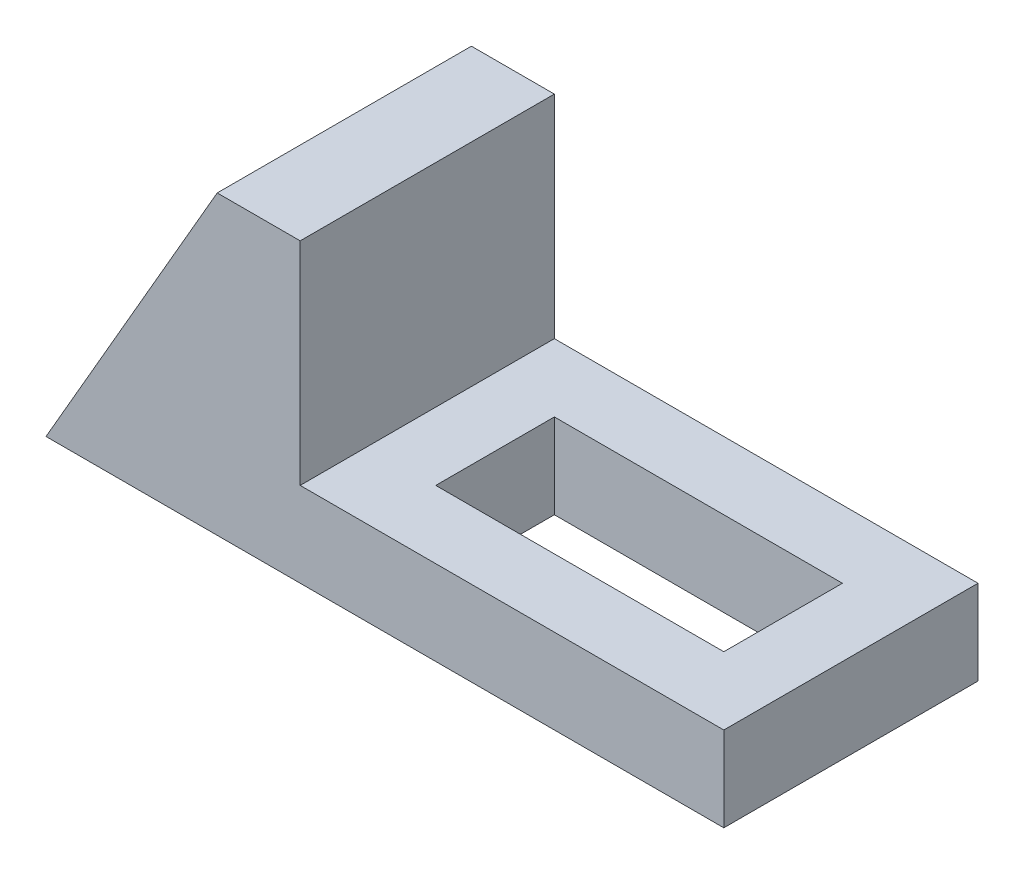
ISO-10303-21;
HEADER;
FILE_DESCRIPTION(('STEP AP214'),'2;1');
FILE_NAME('part.step','',(''),(''),'','','');
FILE_SCHEMA(('AUTOMOTIVE_DESIGN { 1 0 10303 214 1 1 1 1 }'));
ENDSEC;
DATA;
#1=APPLICATION_CONTEXT('core data for automotive mechanical design processes');
#2=APPLICATION_PROTOCOL_DEFINITION('international standard','automotive_design',2000,#1);
#3=PRODUCT_CONTEXT('',#1,'mechanical');
#4=PRODUCT('Part','Part','',(#3));
#5=PRODUCT_RELATED_PRODUCT_CATEGORY('part','',(#4));
#6=PRODUCT_DEFINITION_FORMATION('','',#4);
#7=PRODUCT_DEFINITION_CONTEXT('part definition',#1,'design');
#8=PRODUCT_DEFINITION('design','',#6,#7);
#9=PRODUCT_DEFINITION_SHAPE('','',#8);
#10=(LENGTH_UNIT() NAMED_UNIT(*) SI_UNIT(.MILLI.,.METRE.));
#11=(NAMED_UNIT(*) PLANE_ANGLE_UNIT() SI_UNIT($,.RADIAN.));
#12=(NAMED_UNIT(*) SI_UNIT($,.STERADIAN.) SOLID_ANGLE_UNIT());
#13=UNCERTAINTY_MEASURE_WITH_UNIT(LENGTH_MEASURE(1.E-05),#10,'distance_accuracy_value','');
#14=(GEOMETRIC_REPRESENTATION_CONTEXT(3) GLOBAL_UNCERTAINTY_ASSIGNED_CONTEXT((#13)) GLOBAL_UNIT_ASSIGNED_CONTEXT((#10,
#11,#12)) REPRESENTATION_CONTEXT('',''));
#15=CARTESIAN_POINT('',(0.,0.,0.));
#16=DIRECTION('',(0.,0.,1.));
#17=DIRECTION('',(1.,0.,0.));
#18=AXIS2_PLACEMENT_3D('',#15,#16,#17);
#19=CARTESIAN_POINT('',(80.,0.,30.));
#20=DIRECTION('',(0.,1.,0.));
#21=DIRECTION('',(-1.,0.,0.));
#22=AXIS2_PLACEMENT_3D('',#19,#20,#21);
#23=PLANE('',#22);
#24=DIRECTION('',(-1.,0.,0.));
#25=VECTOR('',#24,1.);
#26=CARTESIAN_POINT('',(80.,0.,8.));
#27=LINE('',#26,#25);
#28=CARTESIAN_POINT('',(72.,0.,8.));
#29=VERTEX_POINT('',#28);
#30=CARTESIAN_POINT('',(38.,0.,8.));
#31=VERTEX_POINT('',#30);
#32=EDGE_CURVE('E140',#29,#31,#27,.T.);
#33=ORIENTED_EDGE('',*,*,#32,.T.);
#34=DIRECTION('',(0.,0.,1.));
#35=VECTOR('',#34,1.);
#36=CARTESIAN_POINT('',(38.,0.,30.));
#37=LINE('',#36,#35);
#38=CARTESIAN_POINT('',(38.,0.,22.));
#39=VERTEX_POINT('',#38);
#40=EDGE_CURVE('E143',#31,#39,#37,.T.);
#41=ORIENTED_EDGE('',*,*,#40,.T.);
#42=DIRECTION('',(1.,0.,0.));
#43=VECTOR('',#42,1.);
#44=CARTESIAN_POINT('',(80.,0.,22.));
#45=LINE('',#44,#43);
#46=CARTESIAN_POINT('',(72.,0.,22.));
#47=VERTEX_POINT('',#46);
#48=EDGE_CURVE('E135',#39,#47,#45,.T.);
#49=ORIENTED_EDGE('',*,*,#48,.T.);
#50=DIRECTION('',(0.,0.,-1.));
#51=VECTOR('',#50,1.);
#52=CARTESIAN_POINT('',(72.,0.,30.));
#53=LINE('',#52,#51);
#54=EDGE_CURVE('E115',#47,#29,#53,.T.);
#55=ORIENTED_EDGE('',*,*,#54,.T.);
#56=EDGE_LOOP('',(#33,#41,#49,#55));
#57=FACE_BOUND('',#56,.T.);
#58=DIRECTION('',(1.,0.,0.));
#59=VECTOR('',#58,1.);
#60=CARTESIAN_POINT('',(80.,0.,0.));
#61=LINE('',#60,#59);
#62=CARTESIAN_POINT('',(0.,0.,0.));
#63=VERTEX_POINT('',#62);
#64=CARTESIAN_POINT('',(80.,0.,0.));
#65=VERTEX_POINT('',#64);
#66=EDGE_CURVE('E146',#63,#65,#61,.T.);
#67=ORIENTED_EDGE('',*,*,#66,.T.);
#68=DIRECTION('',(0.,0.,-1.));
#69=VECTOR('',#68,1.);
#70=CARTESIAN_POINT('',(80.,0.,30.));
#71=LINE('',#70,#69);
#72=CARTESIAN_POINT('',(80.,0.,30.));
#73=VERTEX_POINT('',#72);
#74=EDGE_CURVE('E11',#73,#65,#71,.T.);
#75=ORIENTED_EDGE('',*,*,#74,.F.);
#76=DIRECTION('',(1.,0.,0.));
#77=VECTOR('',#76,1.);
#78=CARTESIAN_POINT('',(80.,0.,30.));
#79=LINE('',#78,#77);
#80=CARTESIAN_POINT('',(0.,0.,30.));
#81=VERTEX_POINT('',#80);
#82=EDGE_CURVE('E147',#81,#73,#79,.T.);
#83=ORIENTED_EDGE('',*,*,#82,.F.);
#84=DIRECTION('',(0.,0.,-1.));
#85=VECTOR('',#84,1.);
#86=CARTESIAN_POINT('',(0.,0.,30.));
#87=LINE('',#86,#85);
#88=EDGE_CURVE('E161',#81,#63,#87,.T.);
#89=ORIENTED_EDGE('',*,*,#88,.T.);
#90=EDGE_LOOP('',(#67,#75,#83,#89));
#91=FACE_BOUND('',#90,.T.);
#92=ADVANCED_FACE('F33',(#57,#91),#23,.F.);
#93=CARTESIAN_POINT('',(80.,10.,30.));
#94=DIRECTION('',(-1.,0.,0.));
#95=DIRECTION('',(0.,0.,1.));
#96=AXIS2_PLACEMENT_3D('',#93,#94,#95);
#97=PLANE('',#96);
#98=DIRECTION('',(0.,1.,0.));
#99=VECTOR('',#98,1.);
#100=CARTESIAN_POINT('',(80.,10.,0.));
#101=LINE('',#100,#99);
#102=CARTESIAN_POINT('',(80.,10.,0.));
#103=VERTEX_POINT('',#102);
#104=EDGE_CURVE('E164',#65,#103,#101,.T.);
#105=ORIENTED_EDGE('',*,*,#104,.T.);
#106=DIRECTION('',(0.,0.,-1.));
#107=VECTOR('',#106,1.);
#108=CARTESIAN_POINT('',(80.,10.,30.));
#109=LINE('',#108,#107);
#110=CARTESIAN_POINT('',(80.,10.,30.));
#111=VERTEX_POINT('',#110);
#112=EDGE_CURVE('E40',#111,#103,#109,.T.);
#113=ORIENTED_EDGE('',*,*,#112,.F.);
#114=DIRECTION('',(0.,1.,0.));
#115=VECTOR('',#114,1.);
#116=CARTESIAN_POINT('',(80.,10.,30.));
#117=LINE('',#116,#115);
#118=EDGE_CURVE('E150',#73,#111,#117,.T.);
#119=ORIENTED_EDGE('',*,*,#118,.F.);
#120=ORIENTED_EDGE('',*,*,#74,.T.);
#121=EDGE_LOOP('',(#105,#113,#119,#120));
#122=FACE_BOUND('',#121,.T.);
#123=ADVANCED_FACE('F209',(#122),#97,.F.);
#124=CARTESIAN_POINT('',(30.,10.,30.));
#125=DIRECTION('',(0.,-1.,0.));
#126=DIRECTION('',(0.,0.,-1.));
#127=AXIS2_PLACEMENT_3D('',#124,#125,#126);
#128=PLANE('',#127);
#129=DIRECTION('',(1.,0.,0.));
#130=VECTOR('',#129,1.);
#131=CARTESIAN_POINT('',(38.,10.,22.));
#132=LINE('',#131,#130);
#133=CARTESIAN_POINT('',(38.,10.,22.));
#134=VERTEX_POINT('',#133);
#135=CARTESIAN_POINT('',(72.,10.,22.));
#136=VERTEX_POINT('',#135);
#137=EDGE_CURVE('E121',#134,#136,#132,.T.);
#138=ORIENTED_EDGE('',*,*,#137,.F.);
#139=DIRECTION('',(0.,0.,1.));
#140=VECTOR('',#139,1.);
#141=CARTESIAN_POINT('',(38.,10.,8.));
#142=LINE('',#141,#140);
#143=CARTESIAN_POINT('',(38.,10.,8.));
#144=VERTEX_POINT('',#143);
#145=EDGE_CURVE('E55',#144,#134,#142,.T.);
#146=ORIENTED_EDGE('',*,*,#145,.F.);
#147=DIRECTION('',(-1.,0.,0.));
#148=VECTOR('',#147,1.);
#149=CARTESIAN_POINT('',(38.,10.,8.));
#150=LINE('',#149,#148);
#151=CARTESIAN_POINT('',(72.,10.,8.));
#152=VERTEX_POINT('',#151);
#153=EDGE_CURVE('E128',#152,#144,#150,.T.);
#154=ORIENTED_EDGE('',*,*,#153,.F.);
#155=DIRECTION('',(0.,0.,-1.));
#156=VECTOR('',#155,1.);
#157=CARTESIAN_POINT('',(72.,10.,8.));
#158=LINE('',#157,#156);
#159=EDGE_CURVE('E112',#136,#152,#158,.T.);
#160=ORIENTED_EDGE('',*,*,#159,.F.);
#161=EDGE_LOOP('',(#138,#146,#154,#160));
#162=FACE_BOUND('',#161,.T.);
#163=DIRECTION('',(-1.,0.,0.));
#164=VECTOR('',#163,1.);
#165=CARTESIAN_POINT('',(30.,10.,0.));
#166=LINE('',#165,#164);
#167=CARTESIAN_POINT('',(30.,10.,0.));
#168=VERTEX_POINT('',#167);
#169=EDGE_CURVE('E166',#103,#168,#166,.T.);
#170=ORIENTED_EDGE('',*,*,#169,.T.);
#171=DIRECTION('',(0.,0.,-1.));
#172=VECTOR('',#171,1.);
#173=CARTESIAN_POINT('',(30.,10.,30.));
#174=LINE('',#173,#172);
#175=CARTESIAN_POINT('',(30.,10.,30.));
#176=VERTEX_POINT('',#175);
#177=EDGE_CURVE('E181',#176,#168,#174,.T.);
#178=ORIENTED_EDGE('',*,*,#177,.F.);
#179=DIRECTION('',(-1.,0.,0.));
#180=VECTOR('',#179,1.);
#181=CARTESIAN_POINT('',(30.,10.,30.));
#182=LINE('',#181,#180);
#183=EDGE_CURVE('E153',#111,#176,#182,.T.);
#184=ORIENTED_EDGE('',*,*,#183,.F.);
#185=ORIENTED_EDGE('',*,*,#112,.T.);
#186=EDGE_LOOP('',(#170,#178,#184,#185));
#187=FACE_BOUND('',#186,.T.);
#188=ADVANCED_FACE('F125',(#162,#187),#128,.F.);
#189=CARTESIAN_POINT('',(30.,35.,30.));
#190=DIRECTION('',(-1.,0.,0.));
#191=DIRECTION('',(0.,-1.,0.));
#192=AXIS2_PLACEMENT_3D('',#189,#190,#191);
#193=PLANE('',#192);
#194=DIRECTION('',(0.,1.,0.));
#195=VECTOR('',#194,1.);
#196=CARTESIAN_POINT('',(30.,35.,0.));
#197=LINE('',#196,#195);
#198=CARTESIAN_POINT('',(30.,35.,0.));
#199=VERTEX_POINT('',#198);
#200=EDGE_CURVE('E168',#168,#199,#197,.T.);
#201=ORIENTED_EDGE('',*,*,#200,.T.);
#202=DIRECTION('',(0.,0.,-1.));
#203=VECTOR('',#202,1.);
#204=CARTESIAN_POINT('',(30.,35.,30.));
#205=LINE('',#204,#203);
#206=CARTESIAN_POINT('',(30.,35.,30.));
#207=VERTEX_POINT('',#206);
#208=EDGE_CURVE('E178',#207,#199,#205,.T.);
#209=ORIENTED_EDGE('',*,*,#208,.F.);
#210=DIRECTION('',(0.,1.,0.));
#211=VECTOR('',#210,1.);
#212=CARTESIAN_POINT('',(30.,35.,30.));
#213=LINE('',#212,#211);
#214=EDGE_CURVE('E155',#176,#207,#213,.T.);
#215=ORIENTED_EDGE('',*,*,#214,.F.);
#216=ORIENTED_EDGE('',*,*,#177,.T.);
#217=EDGE_LOOP('',(#201,#209,#215,#216));
#218=FACE_BOUND('',#217,.T.);
#219=ADVANCED_FACE('F197',(#218),#193,.F.);
#220=CARTESIAN_POINT('',(20.2072594216371,35.,30.));
#221=DIRECTION('',(0.,-1.,0.));
#222=DIRECTION('',(1.,0.,0.));
#223=AXIS2_PLACEMENT_3D('',#220,#221,#222);
#224=PLANE('',#223);
#225=DIRECTION('',(-1.,0.,0.));
#226=VECTOR('',#225,1.);
#227=CARTESIAN_POINT('',(20.2072594216371,35.,0.));
#228=LINE('',#227,#226);
#229=CARTESIAN_POINT('',(20.2072594216371,35.,0.));
#230=VERTEX_POINT('',#229);
#231=EDGE_CURVE('E170',#199,#230,#228,.T.);
#232=ORIENTED_EDGE('',*,*,#231,.T.);
#233=DIRECTION('',(0.,0.,-1.));
#234=VECTOR('',#233,1.);
#235=CARTESIAN_POINT('',(20.2072594216371,35.,30.));
#236=LINE('',#235,#234);
#237=CARTESIAN_POINT('',(20.2072594216371,35.,30.));
#238=VERTEX_POINT('',#237);
#239=EDGE_CURVE('E175',#238,#230,#236,.T.);
#240=ORIENTED_EDGE('',*,*,#239,.F.);
#241=DIRECTION('',(-1.,0.,0.));
#242=VECTOR('',#241,1.);
#243=CARTESIAN_POINT('',(20.2072594216371,35.,30.));
#244=LINE('',#243,#242);
#245=EDGE_CURVE('E157',#207,#238,#244,.T.);
#246=ORIENTED_EDGE('',*,*,#245,.F.);
#247=ORIENTED_EDGE('',*,*,#208,.T.);
#248=EDGE_LOOP('',(#232,#240,#246,#247));
#249=FACE_BOUND('',#248,.T.);
#250=ADVANCED_FACE('F201',(#249),#224,.F.);
#251=CARTESIAN_POINT('',(0.,0.,30.));
#252=DIRECTION('',(0.866025403784436,-0.500000000000004,0.));
#253=DIRECTION('',(0.500000000000004,0.866025403784436,0.));
#254=AXIS2_PLACEMENT_3D('',#251,#252,#253);
#255=PLANE('',#254);
#256=DIRECTION('',(-0.500000000000004,-0.866025403784436,0.));
#257=VECTOR('',#256,1.);
#258=CARTESIAN_POINT('',(0.,0.,0.));
#259=LINE('',#258,#257);
#260=EDGE_CURVE('E151',#230,#63,#259,.T.);
#261=ORIENTED_EDGE('',*,*,#260,.T.);
#262=ORIENTED_EDGE('',*,*,#88,.F.);
#263=DIRECTION('',(-0.500000000000004,-0.866025403784436,0.));
#264=VECTOR('',#263,1.);
#265=CARTESIAN_POINT('',(0.,0.,30.));
#266=LINE('',#265,#264);
#267=EDGE_CURVE('E159',#238,#81,#266,.T.);
#268=ORIENTED_EDGE('',*,*,#267,.F.);
#269=ORIENTED_EDGE('',*,*,#239,.T.);
#270=EDGE_LOOP('',(#261,#262,#268,#269));
#271=FACE_BOUND('',#270,.T.);
#272=ADVANCED_FACE('F212',(#271),#255,.F.);
#273=CARTESIAN_POINT('',(0.,0.,30.));
#274=DIRECTION('',(0.,0.,1.));
#275=DIRECTION('',(1.,0.,0.));
#276=AXIS2_PLACEMENT_3D('',#273,#274,#275);
#277=PLANE('',#276);
#278=ORIENTED_EDGE('',*,*,#82,.T.);
#279=ORIENTED_EDGE('',*,*,#118,.T.);
#280=ORIENTED_EDGE('',*,*,#183,.T.);
#281=ORIENTED_EDGE('',*,*,#214,.T.);
#282=ORIENTED_EDGE('',*,*,#245,.T.);
#283=ORIENTED_EDGE('',*,*,#267,.T.);
#284=EDGE_LOOP('',(#278,#279,#280,#281,#282,#283));
#285=FACE_BOUND('',#284,.T.);
#286=ADVANCED_FACE('F205',(#285),#277,.T.);
#287=CARTESIAN_POINT('',(0.,0.,0.));
#288=DIRECTION('',(0.,0.,1.));
#289=DIRECTION('',(1.,0.,0.));
#290=AXIS2_PLACEMENT_3D('',#287,#288,#289);
#291=PLANE('',#290);
#292=ORIENTED_EDGE('',*,*,#66,.F.);
#293=ORIENTED_EDGE('',*,*,#260,.F.);
#294=ORIENTED_EDGE('',*,*,#231,.F.);
#295=ORIENTED_EDGE('',*,*,#200,.F.);
#296=ORIENTED_EDGE('',*,*,#169,.F.);
#297=ORIENTED_EDGE('',*,*,#104,.F.);
#298=EDGE_LOOP('',(#292,#293,#294,#295,#296,#297));
#299=FACE_BOUND('',#298,.T.);
#300=ADVANCED_FACE('F192',(#299),#291,.F.);
#301=CARTESIAN_POINT('',(38.,-20.,8.));
#302=DIRECTION('',(-1.,0.,0.));
#303=DIRECTION('',(0.,0.,1.));
#304=AXIS2_PLACEMENT_3D('',#301,#302,#303);
#305=PLANE('',#304);
#306=DIRECTION('',(0.,1.,0.));
#307=VECTOR('',#306,1.);
#308=CARTESIAN_POINT('',(38.,-20.,8.));
#309=LINE('',#308,#307);
#310=EDGE_CURVE('E133',#31,#144,#309,.T.);
#311=ORIENTED_EDGE('',*,*,#310,.T.);
#312=ORIENTED_EDGE('',*,*,#145,.T.);
#313=DIRECTION('',(0.,1.,0.));
#314=VECTOR('',#313,1.);
#315=CARTESIAN_POINT('',(38.,-20.,22.));
#316=LINE('',#315,#314);
#317=EDGE_CURVE('E118',#39,#134,#316,.T.);
#318=ORIENTED_EDGE('',*,*,#317,.F.);
#319=ORIENTED_EDGE('',*,*,#40,.F.);
#320=EDGE_LOOP('',(#311,#312,#318,#319));
#321=FACE_BOUND('',#320,.T.);
#322=ADVANCED_FACE('F230',(#321),#305,.F.);
#323=CARTESIAN_POINT('',(38.,-20.,8.));
#324=DIRECTION('',(0.,0.,-1.));
#325=DIRECTION('',(-1.,0.,0.));
#326=AXIS2_PLACEMENT_3D('',#323,#324,#325);
#327=PLANE('',#326);
#328=DIRECTION('',(0.,1.,0.));
#329=VECTOR('',#328,1.);
#330=CARTESIAN_POINT('',(72.,-20.,8.));
#331=LINE('',#330,#329);
#332=EDGE_CURVE('E117',#29,#152,#331,.T.);
#333=ORIENTED_EDGE('',*,*,#332,.T.);
#334=ORIENTED_EDGE('',*,*,#153,.T.);
#335=ORIENTED_EDGE('',*,*,#310,.F.);
#336=ORIENTED_EDGE('',*,*,#32,.F.);
#337=EDGE_LOOP('',(#333,#334,#335,#336));
#338=FACE_BOUND('',#337,.T.);
#339=ADVANCED_FACE('F229',(#338),#327,.F.);
#340=CARTESIAN_POINT('',(72.,-20.,8.));
#341=DIRECTION('',(1.,0.,0.));
#342=DIRECTION('',(0.,0.,-1.));
#343=AXIS2_PLACEMENT_3D('',#340,#341,#342);
#344=PLANE('',#343);
#345=DIRECTION('',(0.,1.,0.));
#346=VECTOR('',#345,1.);
#347=CARTESIAN_POINT('',(72.,-20.,22.));
#348=LINE('',#347,#346);
#349=EDGE_CURVE('E47',#47,#136,#348,.T.);
#350=ORIENTED_EDGE('',*,*,#349,.T.);
#351=ORIENTED_EDGE('',*,*,#159,.T.);
#352=ORIENTED_EDGE('',*,*,#332,.F.);
#353=ORIENTED_EDGE('',*,*,#54,.F.);
#354=EDGE_LOOP('',(#350,#351,#352,#353));
#355=FACE_BOUND('',#354,.T.);
#356=ADVANCED_FACE('F109',(#355),#344,.F.);
#357=CARTESIAN_POINT('',(38.,-20.,22.));
#358=DIRECTION('',(0.,0.,1.));
#359=DIRECTION('',(1.,0.,0.));
#360=AXIS2_PLACEMENT_3D('',#357,#358,#359);
#361=PLANE('',#360);
#362=ORIENTED_EDGE('',*,*,#317,.T.);
#363=ORIENTED_EDGE('',*,*,#137,.T.);
#364=ORIENTED_EDGE('',*,*,#349,.F.);
#365=ORIENTED_EDGE('',*,*,#48,.F.);
#366=EDGE_LOOP('',(#362,#363,#364,#365));
#367=FACE_BOUND('',#366,.T.);
#368=ADVANCED_FACE('F122',(#367),#361,.F.);
#369=CLOSED_SHELL('',(#92,#123,#188,#219,#250,#272,#286,#300,#322,#339,#356,#368));
#370=MANIFOLD_SOLID_BREP('B2',#369);
#371=ADVANCED_BREP_SHAPE_REPRESENTATION('',(#18,#370),#14);
#372=SHAPE_DEFINITION_REPRESENTATION(#9,#371);
ENDSEC;
END-ISO-10303-21;
